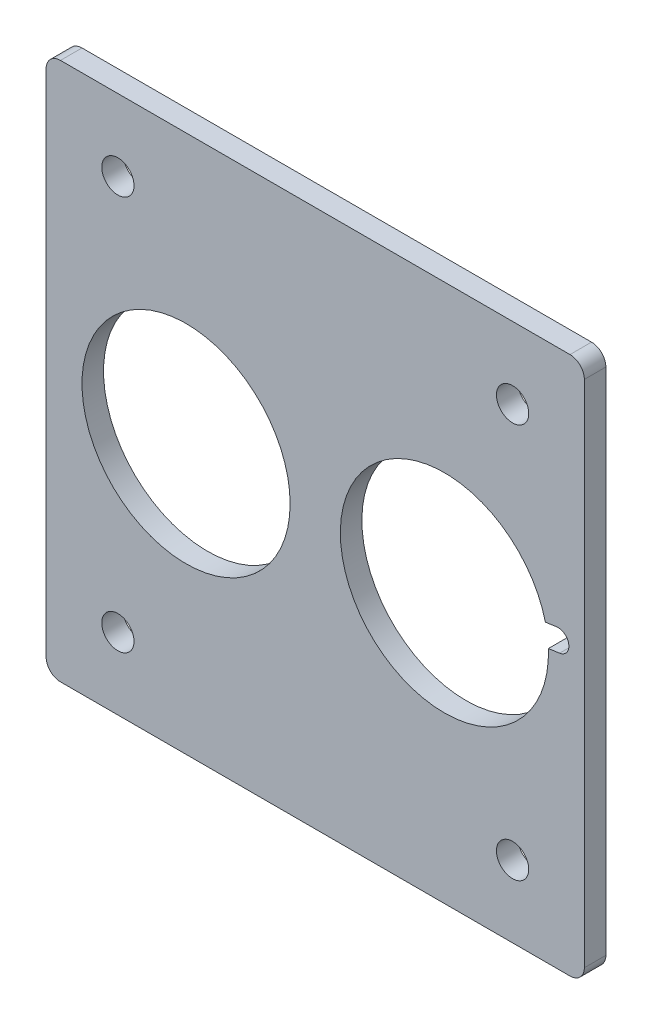
ISO-10303-21;
HEADER;
FILE_DESCRIPTION(('STEP AP214'),'2;1');
FILE_NAME('part.step','',(''),(''),'','','');
FILE_SCHEMA(('AUTOMOTIVE_DESIGN { 1 0 10303 214 1 1 1 1 }'));
ENDSEC;
DATA;
#1=APPLICATION_CONTEXT('core data for automotive mechanical design processes');
#2=APPLICATION_PROTOCOL_DEFINITION('international standard','automotive_design',2000,#1);
#3=PRODUCT_CONTEXT('',#1,'mechanical');
#4=PRODUCT('Part','Part','',(#3));
#5=PRODUCT_RELATED_PRODUCT_CATEGORY('part','',(#4));
#6=PRODUCT_DEFINITION_FORMATION('','',#4);
#7=PRODUCT_DEFINITION_CONTEXT('part definition',#1,'design');
#8=PRODUCT_DEFINITION('design','',#6,#7);
#9=PRODUCT_DEFINITION_SHAPE('','',#8);
#10=(LENGTH_UNIT() NAMED_UNIT(*) SI_UNIT(.MILLI.,.METRE.));
#11=(NAMED_UNIT(*) PLANE_ANGLE_UNIT() SI_UNIT($,.RADIAN.));
#12=(NAMED_UNIT(*) SI_UNIT($,.STERADIAN.) SOLID_ANGLE_UNIT());
#13=UNCERTAINTY_MEASURE_WITH_UNIT(LENGTH_MEASURE(1.E-05),#10,'distance_accuracy_value','');
#14=(GEOMETRIC_REPRESENTATION_CONTEXT(3) GLOBAL_UNCERTAINTY_ASSIGNED_CONTEXT((#13)) GLOBAL_UNIT_ASSIGNED_CONTEXT((#10,
#11,#12)) REPRESENTATION_CONTEXT('',''));
#15=CARTESIAN_POINT('',(0.,0.,0.));
#16=DIRECTION('',(0.,0.,1.));
#17=DIRECTION('',(1.,0.,0.));
#18=AXIS2_PLACEMENT_3D('',#15,#16,#17);
#19=CARTESIAN_POINT('',(0.,0.,3.));
#20=DIRECTION('',(0.,0.,-1.));
#21=DIRECTION('',(-1.,0.,0.));
#22=AXIS2_PLACEMENT_3D('',#19,#20,#21);
#23=PLANE('',#22);
#24=CARTESIAN_POINT('',(-27.5,-27.5,3.));
#25=DIRECTION('',(0.,0.,1.));
#26=DIRECTION('',(1.,0.,0.));
#27=AXIS2_PLACEMENT_3D('',#24,#25,#26);
#28=CIRCLE('',#27,2.25);
#29=CARTESIAN_POINT('',(-25.25,-27.5,3.));
#30=VERTEX_POINT('',#29);
#31=EDGE_CURVE('E154',#30,#30,#28,.T.);
#32=ORIENTED_EDGE('',*,*,#31,.F.);
#33=EDGE_LOOP('',(#32));
#34=FACE_BOUND('',#33,.T.);
#35=DIRECTION('',(0.,-1.,0.));
#36=VECTOR('',#35,1.);
#37=CARTESIAN_POINT('',(-37.5,-37.5,3.));
#38=LINE('',#37,#36);
#39=CARTESIAN_POINT('',(-37.5,35.5,3.));
#40=VERTEX_POINT('',#39);
#41=CARTESIAN_POINT('',(-37.5,-35.5,3.));
#42=VERTEX_POINT('',#41);
#43=EDGE_CURVE('E196',#40,#42,#38,.T.);
#44=ORIENTED_EDGE('',*,*,#43,.T.);
#45=CARTESIAN_POINT('',(-35.5,-35.5,3.));
#46=DIRECTION('',(0.,0.,-1.));
#47=DIRECTION('',(-1.,0.,0.));
#48=AXIS2_PLACEMENT_3D('',#45,#46,#47);
#49=CIRCLE('',#48,2.);
#50=CARTESIAN_POINT('',(-35.5,-37.5,3.));
#51=VERTEX_POINT('',#50);
#52=EDGE_CURVE('E235',#42,#51,#49,.F.);
#53=ORIENTED_EDGE('',*,*,#52,.T.);
#54=DIRECTION('',(1.,0.,0.));
#55=VECTOR('',#54,1.);
#56=CARTESIAN_POINT('',(-37.5,-37.5,3.));
#57=LINE('',#56,#55);
#58=CARTESIAN_POINT('',(35.5,-37.5,3.));
#59=VERTEX_POINT('',#58);
#60=EDGE_CURVE('E199',#51,#59,#57,.T.);
#61=ORIENTED_EDGE('',*,*,#60,.T.);
#62=CARTESIAN_POINT('',(35.5,-35.5,3.));
#63=DIRECTION('',(0.,0.,-1.));
#64=DIRECTION('',(-1.,0.,0.));
#65=AXIS2_PLACEMENT_3D('',#62,#63,#64);
#66=CIRCLE('',#65,2.);
#67=CARTESIAN_POINT('',(37.5,-35.5,3.));
#68=VERTEX_POINT('',#67);
#69=EDGE_CURVE('E231',#59,#68,#66,.F.);
#70=ORIENTED_EDGE('',*,*,#69,.T.);
#71=DIRECTION('',(0.,1.,0.));
#72=VECTOR('',#71,1.);
#73=CARTESIAN_POINT('',(37.5,-37.5,3.));
#74=LINE('',#73,#72);
#75=CARTESIAN_POINT('',(37.5,35.5,3.));
#76=VERTEX_POINT('',#75);
#77=EDGE_CURVE('E190',#68,#76,#74,.T.);
#78=ORIENTED_EDGE('',*,*,#77,.T.);
#79=CARTESIAN_POINT('',(35.5,35.5,3.));
#80=DIRECTION('',(0.,0.,-1.));
#81=DIRECTION('',(-1.,0.,0.));
#82=AXIS2_PLACEMENT_3D('',#79,#80,#81);
#83=CIRCLE('',#82,2.);
#84=CARTESIAN_POINT('',(35.5,37.5,3.));
#85=VERTEX_POINT('',#84);
#86=EDGE_CURVE('E229',#76,#85,#83,.F.);
#87=ORIENTED_EDGE('',*,*,#86,.T.);
#88=DIRECTION('',(-1.,0.,0.));
#89=VECTOR('',#88,1.);
#90=CARTESIAN_POINT('',(-37.5,37.5,3.));
#91=LINE('',#90,#89);
#92=CARTESIAN_POINT('',(-35.5,37.5,3.));
#93=VERTEX_POINT('',#92);
#94=EDGE_CURVE('E193',#85,#93,#91,.T.);
#95=ORIENTED_EDGE('',*,*,#94,.T.);
#96=CARTESIAN_POINT('',(-35.5,35.5,3.));
#97=DIRECTION('',(0.,0.,-1.));
#98=DIRECTION('',(-1.,0.,0.));
#99=AXIS2_PLACEMENT_3D('',#96,#97,#98);
#100=CIRCLE('',#99,2.);
#101=EDGE_CURVE('E233',#93,#40,#100,.F.);
#102=ORIENTED_EDGE('',*,*,#101,.T.);
#103=EDGE_LOOP('',(#44,#53,#61,#70,#78,#87,#95,#102));
#104=FACE_BOUND('',#103,.T.);
#105=CARTESIAN_POINT('',(-18.,0.,3.));
#106=DIRECTION('',(0.,0.,1.));
#107=DIRECTION('',(1.,0.,0.));
#108=AXIS2_PLACEMENT_3D('',#105,#106,#107);
#109=CIRCLE('',#108,14.5);
#110=CARTESIAN_POINT('',(-3.49999999999998,0.,3.));
#111=VERTEX_POINT('',#110);
#112=EDGE_CURVE('E184',#111,#111,#109,.T.);
#113=ORIENTED_EDGE('',*,*,#112,.F.);
#114=EDGE_LOOP('',(#113));
#115=FACE_BOUND('',#114,.T.);
#116=CARTESIAN_POINT('',(27.5,27.5,3.));
#117=DIRECTION('',(0.,0.,1.));
#118=DIRECTION('',(1.,0.,0.));
#119=AXIS2_PLACEMENT_3D('',#116,#117,#118);
#120=CIRCLE('',#119,2.25);
#121=CARTESIAN_POINT('',(29.75,27.5,3.));
#122=VERTEX_POINT('',#121);
#123=EDGE_CURVE('E173',#122,#122,#120,.T.);
#124=ORIENTED_EDGE('',*,*,#123,.F.);
#125=EDGE_LOOP('',(#124));
#126=FACE_BOUND('',#125,.T.);
#127=CARTESIAN_POINT('',(-27.5,27.5,3.));
#128=DIRECTION('',(0.,0.,1.));
#129=DIRECTION('',(1.,0.,0.));
#130=AXIS2_PLACEMENT_3D('',#127,#128,#129);
#131=CIRCLE('',#130,2.25);
#132=CARTESIAN_POINT('',(-25.25,27.5,3.));
#133=VERTEX_POINT('',#132);
#134=EDGE_CURVE('E167',#133,#133,#131,.T.);
#135=ORIENTED_EDGE('',*,*,#134,.F.);
#136=EDGE_LOOP('',(#135));
#137=FACE_BOUND('',#136,.T.);
#138=CARTESIAN_POINT('',(27.5,-27.5,3.));
#139=DIRECTION('',(0.,0.,1.));
#140=DIRECTION('',(1.,0.,0.));
#141=AXIS2_PLACEMENT_3D('',#138,#139,#140);
#142=CIRCLE('',#141,2.25);
#143=CARTESIAN_POINT('',(29.75,-27.5,3.));
#144=VERTEX_POINT('',#143);
#145=EDGE_CURVE('E161',#144,#144,#142,.T.);
#146=ORIENTED_EDGE('',*,*,#145,.F.);
#147=EDGE_LOOP('',(#146));
#148=FACE_BOUND('',#147,.T.);
#149=DIRECTION('',(0.990268068741571,0.139173100960063,0.));
#150=VECTOR('',#149,1.);
#151=CARTESIAN_POINT('',(17.7912403485599,1.48540210311235,3.));
#152=LINE('',#151,#150);
#153=CARTESIAN_POINT('',(32.0730895417696,3.49258510981968,3.));
#154=VERTEX_POINT('',#153);
#155=CARTESIAN_POINT('',(33.6355294484251,3.71217171847336,3.));
#156=VERTEX_POINT('',#155);
#157=EDGE_CURVE('E145',#154,#156,#152,.T.);
#158=ORIENTED_EDGE('',*,*,#157,.T.);
#159=CARTESIAN_POINT('',(33.8442890998652,2.226769615361,3.));
#160=DIRECTION('',(0.,0.,1.));
#161=DIRECTION('',(1.,0.,0.));
#162=AXIS2_PLACEMENT_3D('',#159,#160,#161);
#163=CIRCLE('',#162,1.5);
#164=CARTESIAN_POINT('',(34.0530487513052,0.741367512248641,3.));
#165=VERTEX_POINT('',#164);
#166=EDGE_CURVE('E148',#165,#156,#163,.T.);
#167=ORIENTED_EDGE('',*,*,#166,.F.);
#168=DIRECTION('',(0.990268068741571,0.139173100960062,0.));
#169=VECTOR('',#168,1.);
#170=CARTESIAN_POINT('',(18.2087596514401,-1.48540210311235,3.));
#171=LINE('',#170,#169);
#172=CARTESIAN_POINT('',(32.4906088446498,0.521780903594969,3.));
#173=VERTEX_POINT('',#172);
#174=EDGE_CURVE('E127',#173,#165,#171,.T.);
#175=ORIENTED_EDGE('',*,*,#174,.F.);
#176=CARTESIAN_POINT('',(18.,0.,3.));
#177=DIRECTION('',(0.,0.,1.));
#178=DIRECTION('',(1.,0.,0.));
#179=AXIS2_PLACEMENT_3D('',#176,#177,#178);
#180=CIRCLE('',#179,14.5);
#181=EDGE_CURVE('E179',#154,#173,#180,.T.);
#182=ORIENTED_EDGE('',*,*,#181,.F.);
#183=EDGE_LOOP('',(#158,#167,#175,#182));
#184=FACE_BOUND('',#183,.T.);
#185=ADVANCED_FACE('F35',(#34,#104,#115,#126,#137,#148,#184),#23,.F.);
#186=CARTESIAN_POINT('',(0.,0.,0.));
#187=DIRECTION('',(0.,0.,-1.));
#188=DIRECTION('',(-1.,0.,0.));
#189=AXIS2_PLACEMENT_3D('',#186,#187,#188);
#190=PLANE('',#189);
#191=DIRECTION('',(1.,0.,0.));
#192=VECTOR('',#191,1.);
#193=CARTESIAN_POINT('',(-37.5,-37.5,0.));
#194=LINE('',#193,#192);
#195=CARTESIAN_POINT('',(-35.5,-37.5,0.));
#196=VERTEX_POINT('',#195);
#197=CARTESIAN_POINT('',(35.5,-37.5,0.));
#198=VERTEX_POINT('',#197);
#199=EDGE_CURVE('E194',#196,#198,#194,.T.);
#200=ORIENTED_EDGE('',*,*,#199,.F.);
#201=CARTESIAN_POINT('',(-35.5,-35.5,0.));
#202=DIRECTION('',(0.,0.,-1.));
#203=DIRECTION('',(-1.,0.,0.));
#204=AXIS2_PLACEMENT_3D('',#201,#202,#203);
#205=CIRCLE('',#204,2.);
#206=CARTESIAN_POINT('',(-37.5,-35.5,0.));
#207=VERTEX_POINT('',#206);
#208=EDGE_CURVE('E222',#196,#207,#205,.T.);
#209=ORIENTED_EDGE('',*,*,#208,.T.);
#210=DIRECTION('',(0.,-1.,0.));
#211=VECTOR('',#210,1.);
#212=CARTESIAN_POINT('',(-37.5,-37.5,0.));
#213=LINE('',#212,#211);
#214=CARTESIAN_POINT('',(-37.5,35.5,0.));
#215=VERTEX_POINT('',#214);
#216=EDGE_CURVE('E207',#215,#207,#213,.T.);
#217=ORIENTED_EDGE('',*,*,#216,.F.);
#218=CARTESIAN_POINT('',(-35.5,35.5,0.));
#219=DIRECTION('',(0.,0.,-1.));
#220=DIRECTION('',(-1.,0.,0.));
#221=AXIS2_PLACEMENT_3D('',#218,#219,#220);
#222=CIRCLE('',#221,2.);
#223=CARTESIAN_POINT('',(-35.5,37.5,0.));
#224=VERTEX_POINT('',#223);
#225=EDGE_CURVE('E220',#215,#224,#222,.T.);
#226=ORIENTED_EDGE('',*,*,#225,.T.);
#227=DIRECTION('',(-1.,0.,0.));
#228=VECTOR('',#227,1.);
#229=CARTESIAN_POINT('',(-37.5,37.5,0.));
#230=LINE('',#229,#228);
#231=CARTESIAN_POINT('',(35.5,37.5,0.));
#232=VERTEX_POINT('',#231);
#233=EDGE_CURVE('E205',#232,#224,#230,.T.);
#234=ORIENTED_EDGE('',*,*,#233,.F.);
#235=CARTESIAN_POINT('',(35.5,35.5,0.));
#236=DIRECTION('',(0.,0.,-1.));
#237=DIRECTION('',(-1.,0.,0.));
#238=AXIS2_PLACEMENT_3D('',#235,#236,#237);
#239=CIRCLE('',#238,2.);
#240=CARTESIAN_POINT('',(37.5,35.5,0.));
#241=VERTEX_POINT('',#240);
#242=EDGE_CURVE('E216',#232,#241,#239,.T.);
#243=ORIENTED_EDGE('',*,*,#242,.T.);
#244=DIRECTION('',(0.,1.,0.));
#245=VECTOR('',#244,1.);
#246=CARTESIAN_POINT('',(37.5,-37.5,0.));
#247=LINE('',#246,#245);
#248=CARTESIAN_POINT('',(37.5,-35.5,0.));
#249=VERTEX_POINT('',#248);
#250=EDGE_CURVE('E183',#249,#241,#247,.T.);
#251=ORIENTED_EDGE('',*,*,#250,.F.);
#252=CARTESIAN_POINT('',(35.5,-35.5,0.));
#253=DIRECTION('',(0.,0.,-1.));
#254=DIRECTION('',(-1.,0.,0.));
#255=AXIS2_PLACEMENT_3D('',#252,#253,#254);
#256=CIRCLE('',#255,2.);
#257=EDGE_CURVE('E218',#249,#198,#256,.T.);
#258=ORIENTED_EDGE('',*,*,#257,.T.);
#259=EDGE_LOOP('',(#200,#209,#217,#226,#234,#243,#251,#258));
#260=FACE_BOUND('',#259,.T.);
#261=CARTESIAN_POINT('',(-18.,0.,0.));
#262=DIRECTION('',(0.,0.,1.));
#263=DIRECTION('',(1.,0.,0.));
#264=AXIS2_PLACEMENT_3D('',#261,#262,#263);
#265=CIRCLE('',#264,14.5);
#266=CARTESIAN_POINT('',(-3.49999999999998,0.,0.));
#267=VERTEX_POINT('',#266);
#268=EDGE_CURVE('E180',#267,#267,#265,.T.);
#269=ORIENTED_EDGE('',*,*,#268,.T.);
#270=EDGE_LOOP('',(#269));
#271=FACE_BOUND('',#270,.T.);
#272=CARTESIAN_POINT('',(27.5,27.5,0.));
#273=DIRECTION('',(0.,0.,1.));
#274=DIRECTION('',(1.,0.,0.));
#275=AXIS2_PLACEMENT_3D('',#272,#273,#274);
#276=CIRCLE('',#275,2.25);
#277=CARTESIAN_POINT('',(29.75,27.5,0.));
#278=VERTEX_POINT('',#277);
#279=EDGE_CURVE('E176',#278,#278,#276,.T.);
#280=ORIENTED_EDGE('',*,*,#279,.T.);
#281=EDGE_LOOP('',(#280));
#282=FACE_BOUND('',#281,.T.);
#283=CARTESIAN_POINT('',(-27.5,27.5,0.));
#284=DIRECTION('',(0.,0.,1.));
#285=DIRECTION('',(1.,0.,0.));
#286=AXIS2_PLACEMENT_3D('',#283,#284,#285);
#287=CIRCLE('',#286,2.25);
#288=CARTESIAN_POINT('',(-25.25,27.5,0.));
#289=VERTEX_POINT('',#288);
#290=EDGE_CURVE('E170',#289,#289,#287,.T.);
#291=ORIENTED_EDGE('',*,*,#290,.T.);
#292=EDGE_LOOP('',(#291));
#293=FACE_BOUND('',#292,.T.);
#294=CARTESIAN_POINT('',(27.5,-27.5,0.));
#295=DIRECTION('',(0.,0.,1.));
#296=DIRECTION('',(1.,0.,0.));
#297=AXIS2_PLACEMENT_3D('',#294,#295,#296);
#298=CIRCLE('',#297,2.25);
#299=CARTESIAN_POINT('',(29.75,-27.5,0.));
#300=VERTEX_POINT('',#299);
#301=EDGE_CURVE('E164',#300,#300,#298,.T.);
#302=ORIENTED_EDGE('',*,*,#301,.T.);
#303=EDGE_LOOP('',(#302));
#304=FACE_BOUND('',#303,.T.);
#305=CARTESIAN_POINT('',(-27.5,-27.5,0.));
#306=DIRECTION('',(0.,0.,1.));
#307=DIRECTION('',(1.,0.,0.));
#308=AXIS2_PLACEMENT_3D('',#305,#306,#307);
#309=CIRCLE('',#308,2.25);
#310=CARTESIAN_POINT('',(-25.25,-27.5,0.));
#311=VERTEX_POINT('',#310);
#312=EDGE_CURVE('E158',#311,#311,#309,.T.);
#313=ORIENTED_EDGE('',*,*,#312,.T.);
#314=EDGE_LOOP('',(#313));
#315=FACE_BOUND('',#314,.T.);
#316=CARTESIAN_POINT('',(33.8442890998652,2.226769615361,0.));
#317=DIRECTION('',(0.,0.,1.));
#318=DIRECTION('',(1.,0.,0.));
#319=AXIS2_PLACEMENT_3D('',#316,#317,#318);
#320=CIRCLE('',#319,1.5);
#321=CARTESIAN_POINT('',(34.0530487513052,0.741367512248641,0.));
#322=VERTEX_POINT('',#321);
#323=CARTESIAN_POINT('',(33.6355294484251,3.71217171847336,0.));
#324=VERTEX_POINT('',#323);
#325=EDGE_CURVE('E136',#322,#324,#320,.T.);
#326=ORIENTED_EDGE('',*,*,#325,.T.);
#327=DIRECTION('',(0.990268068741571,0.139173100960063,0.));
#328=VECTOR('',#327,1.);
#329=CARTESIAN_POINT('',(17.7912403485599,1.48540210311235,0.));
#330=LINE('',#329,#328);
#331=CARTESIAN_POINT('',(32.0730895417696,3.49258510981968,0.));
#332=VERTEX_POINT('',#331);
#333=EDGE_CURVE('E132',#332,#324,#330,.T.);
#334=ORIENTED_EDGE('',*,*,#333,.F.);
#335=CARTESIAN_POINT('',(18.,0.,0.));
#336=DIRECTION('',(0.,0.,1.));
#337=DIRECTION('',(1.,0.,0.));
#338=AXIS2_PLACEMENT_3D('',#335,#336,#337);
#339=CIRCLE('',#338,14.5);
#340=CARTESIAN_POINT('',(32.4906088446498,0.521780903594969,0.));
#341=VERTEX_POINT('',#340);
#342=EDGE_CURVE('E144',#332,#341,#339,.T.);
#343=ORIENTED_EDGE('',*,*,#342,.T.);
#344=DIRECTION('',(0.990268068741571,0.139173100960062,0.));
#345=VECTOR('',#344,1.);
#346=CARTESIAN_POINT('',(18.2087596514401,-1.48540210311235,0.));
#347=LINE('',#346,#345);
#348=EDGE_CURVE('E50',#341,#322,#347,.T.);
#349=ORIENTED_EDGE('',*,*,#348,.T.);
#350=EDGE_LOOP('',(#326,#334,#343,#349));
#351=FACE_BOUND('',#350,.T.);
#352=ADVANCED_FACE('F142',(#260,#271,#282,#293,#304,#315,#351),#190,.T.);
#353=CARTESIAN_POINT('',(18.,0.,0.));
#354=DIRECTION('',(0.,0.,1.));
#355=DIRECTION('',(1.,0.,0.));
#356=AXIS2_PLACEMENT_3D('',#353,#354,#355);
#357=CYLINDRICAL_SURFACE('',#356,14.5);
#358=DIRECTION('',(0.,0.,1.));
#359=VECTOR('',#358,1.);
#360=CARTESIAN_POINT('',(32.0730895417696,3.49258510981968,0.));
#361=LINE('',#360,#359);
#362=EDGE_CURVE('E11',#154,#332,#361,.F.);
#363=ORIENTED_EDGE('',*,*,#362,.F.);
#364=ORIENTED_EDGE('',*,*,#181,.T.);
#365=DIRECTION('',(0.,0.,1.));
#366=VECTOR('',#365,1.);
#367=CARTESIAN_POINT('',(32.4906088446498,0.521780903594969,0.));
#368=LINE('',#367,#366);
#369=EDGE_CURVE('E43',#173,#341,#368,.F.);
#370=ORIENTED_EDGE('',*,*,#369,.T.);
#371=ORIENTED_EDGE('',*,*,#342,.F.);
#372=EDGE_LOOP('',(#363,#364,#370,#371));
#373=FACE_BOUND('',#372,.T.);
#374=ADVANCED_FACE('F247',(#373),#357,.F.);
#375=CARTESIAN_POINT('',(37.5,-37.5,3.));
#376=DIRECTION('',(-1.,0.,0.));
#377=DIRECTION('',(0.,0.,1.));
#378=AXIS2_PLACEMENT_3D('',#375,#376,#377);
#379=PLANE('',#378);
#380=ORIENTED_EDGE('',*,*,#77,.F.);
#381=DIRECTION('',(0.,0.,-1.));
#382=VECTOR('',#381,1.);
#383=CARTESIAN_POINT('',(37.5,-35.5,3.));
#384=LINE('',#383,#382);
#385=EDGE_CURVE('E243',#68,#249,#384,.T.);
#386=ORIENTED_EDGE('',*,*,#385,.T.);
#387=ORIENTED_EDGE('',*,*,#250,.T.);
#388=DIRECTION('',(0.,0.,-1.));
#389=VECTOR('',#388,1.);
#390=CARTESIAN_POINT('',(37.5,35.5,3.));
#391=LINE('',#390,#389);
#392=EDGE_CURVE('E241',#241,#76,#391,.F.);
#393=ORIENTED_EDGE('',*,*,#392,.T.);
#394=EDGE_LOOP('',(#380,#386,#387,#393));
#395=FACE_BOUND('',#394,.T.);
#396=ADVANCED_FACE('F289',(#395),#379,.F.);
#397=CARTESIAN_POINT('',(-37.5,37.5,3.));
#398=DIRECTION('',(0.,-1.,0.));
#399=DIRECTION('',(0.,0.,-1.));
#400=AXIS2_PLACEMENT_3D('',#397,#398,#399);
#401=PLANE('',#400);
#402=ORIENTED_EDGE('',*,*,#233,.T.);
#403=DIRECTION('',(0.,0.,-1.));
#404=VECTOR('',#403,1.);
#405=CARTESIAN_POINT('',(-35.5,37.5,3.));
#406=LINE('',#405,#404);
#407=EDGE_CURVE('E58',#224,#93,#406,.F.);
#408=ORIENTED_EDGE('',*,*,#407,.T.);
#409=ORIENTED_EDGE('',*,*,#94,.F.);
#410=DIRECTION('',(0.,0.,-1.));
#411=VECTOR('',#410,1.);
#412=CARTESIAN_POINT('',(35.5,37.5,3.));
#413=LINE('',#412,#411);
#414=EDGE_CURVE('E237',#85,#232,#413,.T.);
#415=ORIENTED_EDGE('',*,*,#414,.T.);
#416=EDGE_LOOP('',(#402,#408,#409,#415));
#417=FACE_BOUND('',#416,.T.);
#418=ADVANCED_FACE('F285',(#417),#401,.F.);
#419=CARTESIAN_POINT('',(-37.5,-37.5,3.));
#420=DIRECTION('',(1.,0.,0.));
#421=DIRECTION('',(0.,0.,-1.));
#422=AXIS2_PLACEMENT_3D('',#419,#420,#421);
#423=PLANE('',#422);
#424=ORIENTED_EDGE('',*,*,#216,.T.);
#425=DIRECTION('',(0.,0.,-1.));
#426=VECTOR('',#425,1.);
#427=CARTESIAN_POINT('',(-37.5,-35.5,3.));
#428=LINE('',#427,#426);
#429=EDGE_CURVE('E227',#207,#42,#428,.F.);
#430=ORIENTED_EDGE('',*,*,#429,.T.);
#431=ORIENTED_EDGE('',*,*,#43,.F.);
#432=DIRECTION('',(0.,0.,-1.));
#433=VECTOR('',#432,1.);
#434=CARTESIAN_POINT('',(-37.5,35.5,3.));
#435=LINE('',#434,#433);
#436=EDGE_CURVE('E224',#40,#215,#435,.T.);
#437=ORIENTED_EDGE('',*,*,#436,.T.);
#438=EDGE_LOOP('',(#424,#430,#431,#437));
#439=FACE_BOUND('',#438,.T.);
#440=ADVANCED_FACE('F281',(#439),#423,.F.);
#441=CARTESIAN_POINT('',(-37.5,-37.5,3.));
#442=DIRECTION('',(0.,1.,0.));
#443=DIRECTION('',(0.,0.,1.));
#444=AXIS2_PLACEMENT_3D('',#441,#442,#443);
#445=PLANE('',#444);
#446=ORIENTED_EDGE('',*,*,#60,.F.);
#447=DIRECTION('',(0.,0.,-1.));
#448=VECTOR('',#447,1.);
#449=CARTESIAN_POINT('',(-35.5,-37.5,3.));
#450=LINE('',#449,#448);
#451=EDGE_CURVE('E213',#51,#196,#450,.T.);
#452=ORIENTED_EDGE('',*,*,#451,.T.);
#453=ORIENTED_EDGE('',*,*,#199,.T.);
#454=DIRECTION('',(0.,0.,-1.));
#455=VECTOR('',#454,1.);
#456=CARTESIAN_POINT('',(35.5,-37.5,3.));
#457=LINE('',#456,#455);
#458=EDGE_CURVE('E202',#198,#59,#457,.F.);
#459=ORIENTED_EDGE('',*,*,#458,.T.);
#460=EDGE_LOOP('',(#446,#452,#453,#459));
#461=FACE_BOUND('',#460,.T.);
#462=ADVANCED_FACE('F277',(#461),#445,.F.);
#463=CARTESIAN_POINT('',(-18.,0.,0.));
#464=DIRECTION('',(0.,0.,1.));
#465=DIRECTION('',(1.,0.,0.));
#466=AXIS2_PLACEMENT_3D('',#463,#464,#465);
#467=CYLINDRICAL_SURFACE('',#466,14.5);
#468=ORIENTED_EDGE('',*,*,#268,.F.);
#469=EDGE_LOOP('',(#468));
#470=FACE_BOUND('',#469,.T.);
#471=ORIENTED_EDGE('',*,*,#112,.T.);
#472=EDGE_LOOP('',(#471));
#473=FACE_BOUND('',#472,.T.);
#474=ADVANCED_FACE('F280',(#470,#473),#467,.F.);
#475=CARTESIAN_POINT('',(-35.5,-35.5,3.));
#476=DIRECTION('',(0.,0.,-1.));
#477=DIRECTION('',(-1.,0.,0.));
#478=AXIS2_PLACEMENT_3D('',#475,#476,#477);
#479=CYLINDRICAL_SURFACE('',#478,2.);
#480=ORIENTED_EDGE('',*,*,#52,.F.);
#481=ORIENTED_EDGE('',*,*,#429,.F.);
#482=ORIENTED_EDGE('',*,*,#208,.F.);
#483=ORIENTED_EDGE('',*,*,#451,.F.);
#484=EDGE_LOOP('',(#480,#481,#482,#483));
#485=FACE_BOUND('',#484,.T.);
#486=ADVANCED_FACE('F293',(#485),#479,.T.);
#487=CARTESIAN_POINT('',(-35.5,35.5,3.));
#488=DIRECTION('',(0.,0.,-1.));
#489=DIRECTION('',(-1.,0.,0.));
#490=AXIS2_PLACEMENT_3D('',#487,#488,#489);
#491=CYLINDRICAL_SURFACE('',#490,2.);
#492=ORIENTED_EDGE('',*,*,#101,.F.);
#493=ORIENTED_EDGE('',*,*,#407,.F.);
#494=ORIENTED_EDGE('',*,*,#225,.F.);
#495=ORIENTED_EDGE('',*,*,#436,.F.);
#496=EDGE_LOOP('',(#492,#493,#494,#495));
#497=FACE_BOUND('',#496,.T.);
#498=ADVANCED_FACE('F296',(#497),#491,.T.);
#499=CARTESIAN_POINT('',(35.5,-35.5,3.));
#500=DIRECTION('',(0.,0.,-1.));
#501=DIRECTION('',(-1.,0.,0.));
#502=AXIS2_PLACEMENT_3D('',#499,#500,#501);
#503=CYLINDRICAL_SURFACE('',#502,2.);
#504=ORIENTED_EDGE('',*,*,#69,.F.);
#505=ORIENTED_EDGE('',*,*,#458,.F.);
#506=ORIENTED_EDGE('',*,*,#257,.F.);
#507=ORIENTED_EDGE('',*,*,#385,.F.);
#508=EDGE_LOOP('',(#504,#505,#506,#507));
#509=FACE_BOUND('',#508,.T.);
#510=ADVANCED_FACE('F299',(#509),#503,.T.);
#511=CARTESIAN_POINT('',(35.5,35.5,3.));
#512=DIRECTION('',(0.,0.,-1.));
#513=DIRECTION('',(-1.,0.,0.));
#514=AXIS2_PLACEMENT_3D('',#511,#512,#513);
#515=CYLINDRICAL_SURFACE('',#514,2.);
#516=ORIENTED_EDGE('',*,*,#86,.F.);
#517=ORIENTED_EDGE('',*,*,#392,.F.);
#518=ORIENTED_EDGE('',*,*,#242,.F.);
#519=ORIENTED_EDGE('',*,*,#414,.F.);
#520=EDGE_LOOP('',(#516,#517,#518,#519));
#521=FACE_BOUND('',#520,.T.);
#522=ADVANCED_FACE('F37',(#521),#515,.T.);
#523=CARTESIAN_POINT('',(27.5,27.5,3.));
#524=DIRECTION('',(0.,0.,1.));
#525=DIRECTION('',(1.,0.,0.));
#526=AXIS2_PLACEMENT_3D('',#523,#524,#525);
#527=CYLINDRICAL_SURFACE('',#526,2.25);
#528=ORIENTED_EDGE('',*,*,#279,.F.);
#529=EDGE_LOOP('',(#528));
#530=FACE_BOUND('',#529,.T.);
#531=ORIENTED_EDGE('',*,*,#123,.T.);
#532=EDGE_LOOP('',(#531));
#533=FACE_BOUND('',#532,.T.);
#534=ADVANCED_FACE('F306',(#530,#533),#527,.F.);
#535=CARTESIAN_POINT('',(-27.5,27.5,3.));
#536=DIRECTION('',(0.,0.,1.));
#537=DIRECTION('',(1.,0.,0.));
#538=AXIS2_PLACEMENT_3D('',#535,#536,#537);
#539=CYLINDRICAL_SURFACE('',#538,2.25);
#540=ORIENTED_EDGE('',*,*,#290,.F.);
#541=EDGE_LOOP('',(#540));
#542=FACE_BOUND('',#541,.T.);
#543=ORIENTED_EDGE('',*,*,#134,.T.);
#544=EDGE_LOOP('',(#543));
#545=FACE_BOUND('',#544,.T.);
#546=ADVANCED_FACE('F341',(#542,#545),#539,.F.);
#547=CARTESIAN_POINT('',(27.5,-27.5,3.));
#548=DIRECTION('',(0.,0.,1.));
#549=DIRECTION('',(1.,0.,0.));
#550=AXIS2_PLACEMENT_3D('',#547,#548,#549);
#551=CYLINDRICAL_SURFACE('',#550,2.25);
#552=ORIENTED_EDGE('',*,*,#301,.F.);
#553=EDGE_LOOP('',(#552));
#554=FACE_BOUND('',#553,.T.);
#555=ORIENTED_EDGE('',*,*,#145,.T.);
#556=EDGE_LOOP('',(#555));
#557=FACE_BOUND('',#556,.T.);
#558=ADVANCED_FACE('F260',(#554,#557),#551,.F.);
#559=CARTESIAN_POINT('',(-27.5,-27.5,3.));
#560=DIRECTION('',(0.,0.,1.));
#561=DIRECTION('',(1.,0.,0.));
#562=AXIS2_PLACEMENT_3D('',#559,#560,#561);
#563=CYLINDRICAL_SURFACE('',#562,2.25);
#564=ORIENTED_EDGE('',*,*,#312,.F.);
#565=EDGE_LOOP('',(#564));
#566=FACE_BOUND('',#565,.T.);
#567=ORIENTED_EDGE('',*,*,#31,.T.);
#568=EDGE_LOOP('',(#567));
#569=FACE_BOUND('',#568,.T.);
#570=ADVANCED_FACE('F253',(#566,#569),#563,.F.);
#571=CARTESIAN_POINT('',(17.7912403485599,1.48540210311235,0.));
#572=DIRECTION('',(0.139173100960063,-0.990268068741571,0.));
#573=DIRECTION('',(0.990268068741571,0.139173100960063,0.));
#574=AXIS2_PLACEMENT_3D('',#571,#572,#573);
#575=PLANE('',#574);
#576=ORIENTED_EDGE('',*,*,#362,.T.);
#577=ORIENTED_EDGE('',*,*,#333,.T.);
#578=DIRECTION('',(0.,0.,1.));
#579=VECTOR('',#578,1.);
#580=CARTESIAN_POINT('',(33.6355294484251,3.71217171847336,0.));
#581=LINE('',#580,#579);
#582=EDGE_CURVE('E131',#324,#156,#581,.T.);
#583=ORIENTED_EDGE('',*,*,#582,.T.);
#584=ORIENTED_EDGE('',*,*,#157,.F.);
#585=EDGE_LOOP('',(#576,#577,#583,#584));
#586=FACE_BOUND('',#585,.T.);
#587=ADVANCED_FACE('F251',(#586),#575,.T.);
#588=CARTESIAN_POINT('',(18.2087596514401,-1.48540210311235,0.));
#589=DIRECTION('',(0.139173100960062,-0.990268068741571,0.));
#590=DIRECTION('',(0.990268068741571,0.139173100960062,0.));
#591=AXIS2_PLACEMENT_3D('',#588,#589,#590);
#592=PLANE('',#591);
#593=ORIENTED_EDGE('',*,*,#174,.T.);
#594=DIRECTION('',(0.,0.,1.));
#595=VECTOR('',#594,1.);
#596=CARTESIAN_POINT('',(34.0530487513052,0.741367512248641,0.));
#597=LINE('',#596,#595);
#598=EDGE_CURVE('E123',#322,#165,#597,.T.);
#599=ORIENTED_EDGE('',*,*,#598,.F.);
#600=ORIENTED_EDGE('',*,*,#348,.F.);
#601=ORIENTED_EDGE('',*,*,#369,.F.);
#602=EDGE_LOOP('',(#593,#599,#600,#601));
#603=FACE_BOUND('',#602,.T.);
#604=ADVANCED_FACE('F125',(#603),#592,.F.);
#605=CARTESIAN_POINT('',(33.8442890998652,2.226769615361,0.));
#606=DIRECTION('',(0.,0.,1.));
#607=DIRECTION('',(1.,0.,0.));
#608=AXIS2_PLACEMENT_3D('',#605,#606,#607);
#609=CYLINDRICAL_SURFACE('',#608,1.5);
#610=ORIENTED_EDGE('',*,*,#166,.T.);
#611=ORIENTED_EDGE('',*,*,#582,.F.);
#612=ORIENTED_EDGE('',*,*,#325,.F.);
#613=ORIENTED_EDGE('',*,*,#598,.T.);
#614=EDGE_LOOP('',(#610,#611,#612,#613));
#615=FACE_BOUND('',#614,.T.);
#616=ADVANCED_FACE('F137',(#615),#609,.F.);
#617=CLOSED_SHELL('',(#185,#352,#374,#396,#418,#440,#462,#474,#486,#498,#510,#522,#534,#546,
#558,#570,#587,#604,#616));
#618=MANIFOLD_SOLID_BREP('B2',#617);
#619=ADVANCED_BREP_SHAPE_REPRESENTATION('',(#18,#618),#14);
#620=SHAPE_DEFINITION_REPRESENTATION(#9,#619);
ENDSEC;
END-ISO-10303-21;
